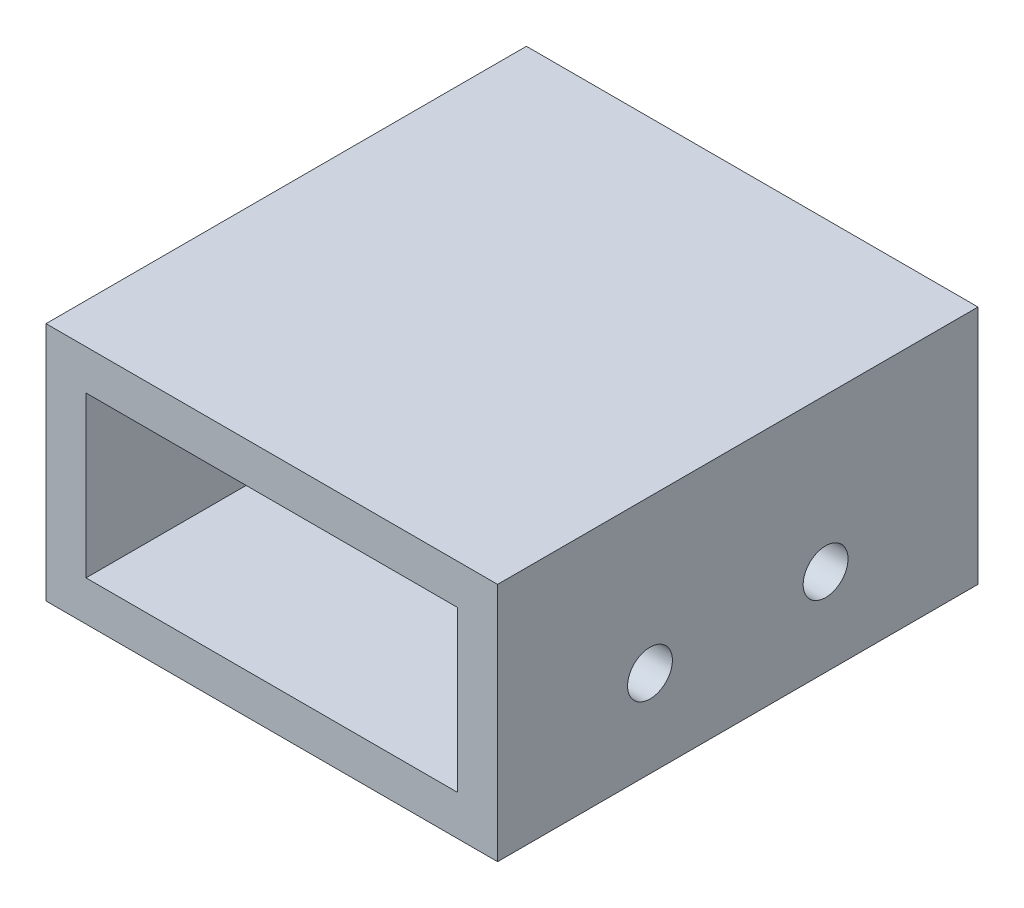
ISO-10303-21;
HEADER;
FILE_DESCRIPTION(('STEP AP214'),'2;1');
FILE_NAME('part.step','',(''),(''),'','','');
FILE_SCHEMA(('AUTOMOTIVE_DESIGN { 1 0 10303 214 1 1 1 1 }'));
ENDSEC;
DATA;
#1=APPLICATION_CONTEXT('core data for automotive mechanical design processes');
#2=APPLICATION_PROTOCOL_DEFINITION('international standard','automotive_design',2000,#1);
#3=PRODUCT_CONTEXT('',#1,'mechanical');
#4=PRODUCT('Part','Part','',(#3));
#5=PRODUCT_RELATED_PRODUCT_CATEGORY('part','',(#4));
#6=PRODUCT_DEFINITION_FORMATION('','',#4);
#7=PRODUCT_DEFINITION_CONTEXT('part definition',#1,'design');
#8=PRODUCT_DEFINITION('design','',#6,#7);
#9=PRODUCT_DEFINITION_SHAPE('','',#8);
#10=(LENGTH_UNIT() NAMED_UNIT(*) SI_UNIT(.MILLI.,.METRE.));
#11=(NAMED_UNIT(*) PLANE_ANGLE_UNIT() SI_UNIT($,.RADIAN.));
#12=(NAMED_UNIT(*) SI_UNIT($,.STERADIAN.) SOLID_ANGLE_UNIT());
#13=UNCERTAINTY_MEASURE_WITH_UNIT(LENGTH_MEASURE(1.E-05),#10,'distance_accuracy_value','');
#14=(GEOMETRIC_REPRESENTATION_CONTEXT(3) GLOBAL_UNCERTAINTY_ASSIGNED_CONTEXT((#13)) GLOBAL_UNIT_ASSIGNED_CONTEXT((#10,
#11,#12)) REPRESENTATION_CONTEXT('',''));
#15=CARTESIAN_POINT('',(0.,0.,0.));
#16=DIRECTION('',(0.,0.,1.));
#17=DIRECTION('',(1.,0.,0.));
#18=AXIS2_PLACEMENT_3D('',#15,#16,#17);
#19=CARTESIAN_POINT('',(-3.175,15.875,-38.1));
#20=DIRECTION('',(-1.,0.,0.));
#21=DIRECTION('',(0.,-1.,0.));
#22=AXIS2_PLACEMENT_3D('',#19,#20,#21);
#23=PLANE('',#22);
#24=DIRECTION('',(0.,0.,1.));
#25=VECTOR('',#24,1.);
#26=CARTESIAN_POINT('',(-3.175,3.175,-38.1));
#27=LINE('',#26,#25);
#28=CARTESIAN_POINT('',(-3.175,3.175,-38.1));
#29=VERTEX_POINT('',#28);
#30=CARTESIAN_POINT('',(-3.175,3.175,0.));
#31=VERTEX_POINT('',#30);
#32=EDGE_CURVE('E146',#29,#31,#27,.T.);
#33=ORIENTED_EDGE('',*,*,#32,.T.);
#34=DIRECTION('',(0.,-1.,0.));
#35=VECTOR('',#34,1.);
#36=CARTESIAN_POINT('',(-3.175,15.875,0.));
#37=LINE('',#36,#35);
#38=CARTESIAN_POINT('',(-3.175,15.875,0.));
#39=VERTEX_POINT('',#38);
#40=EDGE_CURVE('E185',#39,#31,#37,.T.);
#41=ORIENTED_EDGE('',*,*,#40,.F.);
#42=DIRECTION('',(0.,0.,1.));
#43=VECTOR('',#42,1.);
#44=CARTESIAN_POINT('',(-3.175,15.875,-38.1));
#45=LINE('',#44,#43);
#46=CARTESIAN_POINT('',(-3.175,15.875,-38.1));
#47=VERTEX_POINT('',#46);
#48=EDGE_CURVE('E12',#47,#39,#45,.T.);
#49=ORIENTED_EDGE('',*,*,#48,.F.);
#50=DIRECTION('',(0.,-1.,0.));
#51=VECTOR('',#50,1.);
#52=CARTESIAN_POINT('',(-3.175,15.875,-38.1));
#53=LINE('',#52,#51);
#54=EDGE_CURVE('E158',#47,#29,#53,.T.);
#55=ORIENTED_EDGE('',*,*,#54,.T.);
#56=EDGE_LOOP('',(#33,#41,#49,#55));
#57=FACE_BOUND('',#56,.T.);
#58=CARTESIAN_POINT('',(-3.175,6.91388,-12.0859042));
#59=DIRECTION('',(-1.,0.,0.));
#60=DIRECTION('',(0.,-1.,0.));
#61=AXIS2_PLACEMENT_3D('',#58,#59,#60);
#62=CIRCLE('',#61,1.778);
#63=CARTESIAN_POINT('',(-3.175,5.13588,-12.0859042));
#64=VERTEX_POINT('',#63);
#65=EDGE_CURVE('E166',#64,#64,#62,.T.);
#66=ORIENTED_EDGE('',*,*,#65,.F.);
#67=EDGE_LOOP('',(#66));
#68=FACE_BOUND('',#67,.T.);
#69=CARTESIAN_POINT('',(-3.175,6.91388,-26.0140958));
#70=DIRECTION('',(-1.,0.,0.));
#71=DIRECTION('',(0.,-1.,0.));
#72=AXIS2_PLACEMENT_3D('',#69,#70,#71);
#73=CIRCLE('',#72,1.778);
#74=CARTESIAN_POINT('',(-3.175,5.13588,-26.0140958));
#75=VERTEX_POINT('',#74);
#76=EDGE_CURVE('E225',#75,#75,#73,.T.);
#77=ORIENTED_EDGE('',*,*,#76,.F.);
#78=EDGE_LOOP('',(#77));
#79=FACE_BOUND('',#78,.T.);
#80=ADVANCED_FACE('F51',(#57,#68,#79),#23,.T.);
#81=CARTESIAN_POINT('',(-32.639,15.875,-38.1));
#82=DIRECTION('',(0.,-1.,0.));
#83=DIRECTION('',(0.,0.,-1.));
#84=AXIS2_PLACEMENT_3D('',#81,#82,#83);
#85=PLANE('',#84);
#86=DIRECTION('',(1.,0.,0.));
#87=VECTOR('',#86,1.);
#88=CARTESIAN_POINT('',(-32.639,15.875,0.));
#89=LINE('',#88,#87);
#90=CARTESIAN_POINT('',(-32.639,15.875,0.));
#91=VERTEX_POINT('',#90);
#92=EDGE_CURVE('E182',#91,#39,#89,.T.);
#93=ORIENTED_EDGE('',*,*,#92,.F.);
#94=DIRECTION('',(0.,0.,1.));
#95=VECTOR('',#94,1.);
#96=CARTESIAN_POINT('',(-32.639,15.875,-38.1));
#97=LINE('',#96,#95);
#98=CARTESIAN_POINT('',(-32.639,15.875,-38.1));
#99=VERTEX_POINT('',#98);
#100=EDGE_CURVE('E62',#99,#91,#97,.T.);
#101=ORIENTED_EDGE('',*,*,#100,.F.);
#102=DIRECTION('',(1.,0.,0.));
#103=VECTOR('',#102,1.);
#104=CARTESIAN_POINT('',(-32.639,15.875,-38.1));
#105=LINE('',#104,#103);
#106=EDGE_CURVE('E141',#99,#47,#105,.T.);
#107=ORIENTED_EDGE('',*,*,#106,.T.);
#108=ORIENTED_EDGE('',*,*,#48,.T.);
#109=EDGE_LOOP('',(#93,#101,#107,#108));
#110=FACE_BOUND('',#109,.T.);
#111=ADVANCED_FACE('F278',(#110),#85,.T.);
#112=CARTESIAN_POINT('',(-32.639,3.175,-38.1));
#113=DIRECTION('',(1.,0.,0.));
#114=DIRECTION('',(0.,0.,-1.));
#115=AXIS2_PLACEMENT_3D('',#112,#113,#114);
#116=PLANE('',#115);
#117=DIRECTION('',(0.,1.,0.));
#118=VECTOR('',#117,1.);
#119=CARTESIAN_POINT('',(-32.639,3.175,0.));
#120=LINE('',#119,#118);
#121=CARTESIAN_POINT('',(-32.639,3.175,0.));
#122=VERTEX_POINT('',#121);
#123=EDGE_CURVE('E125',#122,#91,#120,.T.);
#124=ORIENTED_EDGE('',*,*,#123,.F.);
#125=DIRECTION('',(0.,0.,1.));
#126=VECTOR('',#125,1.);
#127=CARTESIAN_POINT('',(-32.639,3.175,-38.1));
#128=LINE('',#127,#126);
#129=CARTESIAN_POINT('',(-32.639,3.175,-38.1));
#130=VERTEX_POINT('',#129);
#131=EDGE_CURVE('E120',#130,#122,#128,.T.);
#132=ORIENTED_EDGE('',*,*,#131,.F.);
#133=DIRECTION('',(0.,1.,0.));
#134=VECTOR('',#133,1.);
#135=CARTESIAN_POINT('',(-32.639,3.175,-38.1));
#136=LINE('',#135,#134);
#137=EDGE_CURVE('E123',#130,#99,#136,.T.);
#138=ORIENTED_EDGE('',*,*,#137,.T.);
#139=ORIENTED_EDGE('',*,*,#100,.T.);
#140=EDGE_LOOP('',(#124,#132,#138,#139));
#141=FACE_BOUND('',#140,.T.);
#142=ADVANCED_FACE('F122',(#141),#116,.T.);
#143=CARTESIAN_POINT('',(-21.209,3.175,-38.1));
#144=DIRECTION('',(0.,1.,0.));
#145=DIRECTION('',(-1.,0.,0.));
#146=AXIS2_PLACEMENT_3D('',#143,#144,#145);
#147=PLANE('',#146);
#148=CARTESIAN_POINT('',(-26.543,3.175,-19.05));
#149=DIRECTION('',(0.,1.,0.));
#150=DIRECTION('',(-1.,0.,0.));
#151=AXIS2_PLACEMENT_3D('',#148,#149,#150);
#152=CIRCLE('',#151,1.778);
#153=CARTESIAN_POINT('',(-28.321,3.175,-19.05));
#154=VERTEX_POINT('',#153);
#155=EDGE_CURVE('E239',#154,#154,#152,.T.);
#156=ORIENTED_EDGE('',*,*,#155,.F.);
#157=EDGE_LOOP('',(#156));
#158=FACE_BOUND('',#157,.T.);
#159=CARTESIAN_POINT('',(-7.747,3.175,-19.05));
#160=DIRECTION('',(0.,1.,0.));
#161=DIRECTION('',(-1.,0.,0.));
#162=AXIS2_PLACEMENT_3D('',#159,#160,#161);
#163=CIRCLE('',#162,1.778);
#164=CARTESIAN_POINT('',(-9.525,3.175,-19.05));
#165=VERTEX_POINT('',#164);
#166=EDGE_CURVE('E243',#165,#165,#163,.T.);
#167=ORIENTED_EDGE('',*,*,#166,.F.);
#168=EDGE_LOOP('',(#167));
#169=FACE_BOUND('',#168,.T.);
#170=DIRECTION('',(-1.,0.,0.));
#171=VECTOR('',#170,1.);
#172=CARTESIAN_POINT('',(-21.209,3.175,0.));
#173=LINE('',#172,#171);
#174=EDGE_CURVE('E177',#31,#122,#173,.T.);
#175=ORIENTED_EDGE('',*,*,#174,.F.);
#176=ORIENTED_EDGE('',*,*,#32,.F.);
#177=DIRECTION('',(-1.,0.,0.));
#178=VECTOR('',#177,1.);
#179=CARTESIAN_POINT('',(-21.209,3.175,-38.1));
#180=LINE('',#179,#178);
#181=EDGE_CURVE('E139',#29,#130,#180,.T.);
#182=ORIENTED_EDGE('',*,*,#181,.T.);
#183=ORIENTED_EDGE('',*,*,#131,.T.);
#184=EDGE_LOOP('',(#175,#176,#182,#183));
#185=FACE_BOUND('',#184,.T.);
#186=ADVANCED_FACE('F144',(#158,#169,#185),#147,.T.);
#187=CARTESIAN_POINT('',(-35.814,0.,-38.1));
#188=DIRECTION('',(0.,-1.,0.));
#189=DIRECTION('',(0.,0.,-1.));
#190=AXIS2_PLACEMENT_3D('',#187,#188,#189);
#191=PLANE('',#190);
#192=CARTESIAN_POINT('',(-26.543,0.,-19.05));
#193=DIRECTION('',(0.,-1.,0.));
#194=DIRECTION('',(0.,0.,-1.));
#195=AXIS2_PLACEMENT_3D('',#192,#193,#194);
#196=CIRCLE('',#195,1.778);
#197=CARTESIAN_POINT('',(-26.543,0.,-20.828));
#198=VERTEX_POINT('',#197);
#199=EDGE_CURVE('E247',#198,#198,#196,.T.);
#200=ORIENTED_EDGE('',*,*,#199,.F.);
#201=EDGE_LOOP('',(#200));
#202=FACE_BOUND('',#201,.T.);
#203=CARTESIAN_POINT('',(-7.747,0.,-19.05));
#204=DIRECTION('',(0.,-1.,0.));
#205=DIRECTION('',(0.,0.,-1.));
#206=AXIS2_PLACEMENT_3D('',#203,#204,#205);
#207=CIRCLE('',#206,1.778);
#208=CARTESIAN_POINT('',(-7.747,0.,-20.828));
#209=VERTEX_POINT('',#208);
#210=EDGE_CURVE('E248',#209,#209,#207,.T.);
#211=ORIENTED_EDGE('',*,*,#210,.F.);
#212=EDGE_LOOP('',(#211));
#213=FACE_BOUND('',#212,.T.);
#214=DIRECTION('',(1.,0.,0.));
#215=VECTOR('',#214,1.);
#216=CARTESIAN_POINT('',(-35.814,0.,0.));
#217=LINE('',#216,#215);
#218=CARTESIAN_POINT('',(-35.814,0.,0.));
#219=VERTEX_POINT('',#218);
#220=CARTESIAN_POINT('',(0.,0.,0.));
#221=VERTEX_POINT('',#220);
#222=EDGE_CURVE('E174',#219,#221,#217,.T.);
#223=ORIENTED_EDGE('',*,*,#222,.F.);
#224=DIRECTION('',(0.,0.,1.));
#225=VECTOR('',#224,1.);
#226=CARTESIAN_POINT('',(-35.814,0.,-38.1));
#227=LINE('',#226,#225);
#228=CARTESIAN_POINT('',(-35.814,0.,-38.1));
#229=VERTEX_POINT('',#228);
#230=EDGE_CURVE('E131',#229,#219,#227,.T.);
#231=ORIENTED_EDGE('',*,*,#230,.F.);
#232=DIRECTION('',(1.,0.,0.));
#233=VECTOR('',#232,1.);
#234=CARTESIAN_POINT('',(-3.175,0.,-38.1));
#235=LINE('',#234,#233);
#236=CARTESIAN_POINT('',(0.,0.,-38.1));
#237=VERTEX_POINT('',#236);
#238=EDGE_CURVE('E188',#229,#237,#235,.T.);
#239=ORIENTED_EDGE('',*,*,#238,.T.);
#240=DIRECTION('',(0.,0.,1.));
#241=VECTOR('',#240,1.);
#242=CARTESIAN_POINT('',(0.,0.,-38.1));
#243=LINE('',#242,#241);
#244=EDGE_CURVE('E55',#237,#221,#243,.T.);
#245=ORIENTED_EDGE('',*,*,#244,.T.);
#246=EDGE_LOOP('',(#223,#231,#239,#245));
#247=FACE_BOUND('',#246,.T.);
#248=ADVANCED_FACE('F203',(#202,#213,#247),#191,.T.);
#249=CARTESIAN_POINT('',(-35.814,19.05,-38.1));
#250=DIRECTION('',(-1.,0.,0.));
#251=DIRECTION('',(0.,0.,1.));
#252=AXIS2_PLACEMENT_3D('',#249,#250,#251);
#253=PLANE('',#252);
#254=DIRECTION('',(0.,-1.,0.));
#255=VECTOR('',#254,1.);
#256=CARTESIAN_POINT('',(-35.814,19.05,0.));
#257=LINE('',#256,#255);
#258=CARTESIAN_POINT('',(-35.814,19.05,0.));
#259=VERTEX_POINT('',#258);
#260=EDGE_CURVE('E170',#259,#219,#257,.T.);
#261=ORIENTED_EDGE('',*,*,#260,.F.);
#262=DIRECTION('',(0.,0.,1.));
#263=VECTOR('',#262,1.);
#264=CARTESIAN_POINT('',(-35.814,19.05,-38.1));
#265=LINE('',#264,#263);
#266=CARTESIAN_POINT('',(-35.814,19.05,-38.1));
#267=VERTEX_POINT('',#266);
#268=EDGE_CURVE('E194',#267,#259,#265,.T.);
#269=ORIENTED_EDGE('',*,*,#268,.F.);
#270=DIRECTION('',(0.,-1.,0.));
#271=VECTOR('',#270,1.);
#272=CARTESIAN_POINT('',(-35.814,19.05,-38.1));
#273=LINE('',#272,#271);
#274=EDGE_CURVE('E148',#267,#229,#273,.T.);
#275=ORIENTED_EDGE('',*,*,#274,.T.);
#276=ORIENTED_EDGE('',*,*,#230,.T.);
#277=EDGE_LOOP('',(#261,#269,#275,#276));
#278=FACE_BOUND('',#277,.T.);
#279=ADVANCED_FACE('F209',(#278),#253,.T.);
#280=CARTESIAN_POINT('',(0.,19.05,-38.1));
#281=DIRECTION('',(0.,1.,0.));
#282=DIRECTION('',(-1.,0.,0.));
#283=AXIS2_PLACEMENT_3D('',#280,#281,#282);
#284=PLANE('',#283);
#285=DIRECTION('',(-1.,0.,0.));
#286=VECTOR('',#285,1.);
#287=CARTESIAN_POINT('',(0.,19.05,0.));
#288=LINE('',#287,#286);
#289=CARTESIAN_POINT('',(0.,19.05,0.));
#290=VERTEX_POINT('',#289);
#291=EDGE_CURVE('E165',#290,#259,#288,.T.);
#292=ORIENTED_EDGE('',*,*,#291,.F.);
#293=DIRECTION('',(0.,0.,1.));
#294=VECTOR('',#293,1.);
#295=CARTESIAN_POINT('',(0.,19.05,-38.1));
#296=LINE('',#295,#294);
#297=CARTESIAN_POINT('',(0.,19.05,-38.1));
#298=VERTEX_POINT('',#297);
#299=EDGE_CURVE('E196',#298,#290,#296,.T.);
#300=ORIENTED_EDGE('',*,*,#299,.F.);
#301=DIRECTION('',(-1.,0.,0.));
#302=VECTOR('',#301,1.);
#303=CARTESIAN_POINT('',(0.,19.05,-38.1));
#304=LINE('',#303,#302);
#305=EDGE_CURVE('E152',#298,#267,#304,.T.);
#306=ORIENTED_EDGE('',*,*,#305,.T.);
#307=ORIENTED_EDGE('',*,*,#268,.T.);
#308=EDGE_LOOP('',(#292,#300,#306,#307));
#309=FACE_BOUND('',#308,.T.);
#310=ADVANCED_FACE('F214',(#309),#284,.T.);
#311=CARTESIAN_POINT('',(0.,0.,-38.1));
#312=DIRECTION('',(1.,0.,0.));
#313=DIRECTION('',(0.,0.,-1.));
#314=AXIS2_PLACEMENT_3D('',#311,#312,#313);
#315=PLANE('',#314);
#316=CARTESIAN_POINT('',(0.,6.91388,-12.0859042));
#317=DIRECTION('',(1.,0.,0.));
#318=DIRECTION('',(0.,0.,-1.));
#319=AXIS2_PLACEMENT_3D('',#316,#317,#318);
#320=CIRCLE('',#319,1.778);
#321=CARTESIAN_POINT('',(0.,6.91388,-13.8639042));
#322=VERTEX_POINT('',#321);
#323=EDGE_CURVE('E229',#322,#322,#320,.T.);
#324=ORIENTED_EDGE('',*,*,#323,.F.);
#325=EDGE_LOOP('',(#324));
#326=FACE_BOUND('',#325,.T.);
#327=CARTESIAN_POINT('',(0.,6.91388,-26.0140958));
#328=DIRECTION('',(1.,0.,0.));
#329=DIRECTION('',(0.,0.,-1.));
#330=AXIS2_PLACEMENT_3D('',#327,#328,#329);
#331=CIRCLE('',#330,1.778);
#332=CARTESIAN_POINT('',(0.,6.91388,-27.7920958));
#333=VERTEX_POINT('',#332);
#334=EDGE_CURVE('E230',#333,#333,#331,.T.);
#335=ORIENTED_EDGE('',*,*,#334,.F.);
#336=EDGE_LOOP('',(#335));
#337=FACE_BOUND('',#336,.T.);
#338=DIRECTION('',(0.,1.,0.));
#339=VECTOR('',#338,1.);
#340=CARTESIAN_POINT('',(0.,0.,0.));
#341=LINE('',#340,#339);
#342=EDGE_CURVE('E161',#221,#290,#341,.T.);
#343=ORIENTED_EDGE('',*,*,#342,.F.);
#344=ORIENTED_EDGE('',*,*,#244,.F.);
#345=DIRECTION('',(0.,1.,0.));
#346=VECTOR('',#345,1.);
#347=CARTESIAN_POINT('',(0.,0.,-38.1));
#348=LINE('',#347,#346);
#349=EDGE_CURVE('E216',#237,#298,#348,.T.);
#350=ORIENTED_EDGE('',*,*,#349,.T.);
#351=ORIENTED_EDGE('',*,*,#299,.T.);
#352=EDGE_LOOP('',(#343,#344,#350,#351));
#353=FACE_BOUND('',#352,.T.);
#354=ADVANCED_FACE('F53',(#326,#337,#353),#315,.T.);
#355=CARTESIAN_POINT('',(0.,0.,-38.1));
#356=DIRECTION('',(0.,0.,1.));
#357=DIRECTION('',(1.,0.,0.));
#358=AXIS2_PLACEMENT_3D('',#355,#356,#357);
#359=PLANE('',#358);
#360=ORIENTED_EDGE('',*,*,#181,.F.);
#361=ORIENTED_EDGE('',*,*,#54,.F.);
#362=ORIENTED_EDGE('',*,*,#106,.F.);
#363=ORIENTED_EDGE('',*,*,#137,.F.);
#364=EDGE_LOOP('',(#360,#361,#362,#363));
#365=FACE_BOUND('',#364,.T.);
#366=ORIENTED_EDGE('',*,*,#238,.F.);
#367=ORIENTED_EDGE('',*,*,#274,.F.);
#368=ORIENTED_EDGE('',*,*,#305,.F.);
#369=ORIENTED_EDGE('',*,*,#349,.F.);
#370=EDGE_LOOP('',(#366,#367,#368,#369));
#371=FACE_BOUND('',#370,.T.);
#372=ADVANCED_FACE('F136',(#365,#371),#359,.F.);
#373=CARTESIAN_POINT('',(0.,0.,0.));
#374=DIRECTION('',(0.,0.,1.));
#375=DIRECTION('',(1.,0.,0.));
#376=AXIS2_PLACEMENT_3D('',#373,#374,#375);
#377=PLANE('',#376);
#378=ORIENTED_EDGE('',*,*,#40,.T.);
#379=ORIENTED_EDGE('',*,*,#174,.T.);
#380=ORIENTED_EDGE('',*,*,#123,.T.);
#381=ORIENTED_EDGE('',*,*,#92,.T.);
#382=EDGE_LOOP('',(#378,#379,#380,#381));
#383=FACE_BOUND('',#382,.T.);
#384=ORIENTED_EDGE('',*,*,#222,.T.);
#385=ORIENTED_EDGE('',*,*,#342,.T.);
#386=ORIENTED_EDGE('',*,*,#291,.T.);
#387=ORIENTED_EDGE('',*,*,#260,.T.);
#388=EDGE_LOOP('',(#384,#385,#386,#387));
#389=FACE_BOUND('',#388,.T.);
#390=ADVANCED_FACE('F206',(#383,#389),#377,.T.);
#391=CARTESIAN_POINT('',(-15.24,6.91388,-26.0140958));
#392=DIRECTION('',(1.,0.,0.));
#393=DIRECTION('',(0.,0.,-1.));
#394=AXIS2_PLACEMENT_3D('',#391,#392,#393);
#395=CYLINDRICAL_SURFACE('',#394,1.778);
#396=ORIENTED_EDGE('',*,*,#76,.T.);
#397=EDGE_LOOP('',(#396));
#398=FACE_BOUND('',#397,.T.);
#399=ORIENTED_EDGE('',*,*,#334,.T.);
#400=EDGE_LOOP('',(#399));
#401=FACE_BOUND('',#400,.T.);
#402=ADVANCED_FACE('F274',(#398,#401),#395,.F.);
#403=CARTESIAN_POINT('',(-15.24,6.91388,-12.0859042));
#404=DIRECTION('',(1.,0.,0.));
#405=DIRECTION('',(0.,0.,-1.));
#406=AXIS2_PLACEMENT_3D('',#403,#404,#405);
#407=CYLINDRICAL_SURFACE('',#406,1.778);
#408=ORIENTED_EDGE('',*,*,#65,.T.);
#409=EDGE_LOOP('',(#408));
#410=FACE_BOUND('',#409,.T.);
#411=ORIENTED_EDGE('',*,*,#323,.T.);
#412=EDGE_LOOP('',(#411));
#413=FACE_BOUND('',#412,.T.);
#414=ADVANCED_FACE('F265',(#410,#413),#407,.F.);
#415=CARTESIAN_POINT('',(-7.747,15.24,-19.05));
#416=DIRECTION('',(0.,-1.,0.));
#417=DIRECTION('',(0.,0.,-1.));
#418=AXIS2_PLACEMENT_3D('',#415,#416,#417);
#419=CYLINDRICAL_SURFACE('',#418,1.778);
#420=ORIENTED_EDGE('',*,*,#166,.T.);
#421=EDGE_LOOP('',(#420));
#422=FACE_BOUND('',#421,.T.);
#423=ORIENTED_EDGE('',*,*,#210,.T.);
#424=EDGE_LOOP('',(#423));
#425=FACE_BOUND('',#424,.T.);
#426=ADVANCED_FACE('F263',(#422,#425),#419,.F.);
#427=CARTESIAN_POINT('',(-26.543,15.24,-19.05));
#428=DIRECTION('',(0.,-1.,0.));
#429=DIRECTION('',(0.,0.,-1.));
#430=AXIS2_PLACEMENT_3D('',#427,#428,#429);
#431=CYLINDRICAL_SURFACE('',#430,1.778);
#432=ORIENTED_EDGE('',*,*,#155,.T.);
#433=EDGE_LOOP('',(#432));
#434=FACE_BOUND('',#433,.T.);
#435=ORIENTED_EDGE('',*,*,#199,.T.);
#436=EDGE_LOOP('',(#435));
#437=FACE_BOUND('',#436,.T.);
#438=ADVANCED_FACE('F256',(#434,#437),#431,.F.);
#439=CLOSED_SHELL('',(#80,#111,#142,#186,#248,#279,#310,#354,#372,#390,#402,#414,#426,#438));
#440=MANIFOLD_SOLID_BREP('B2',#439);
#441=ADVANCED_BREP_SHAPE_REPRESENTATION('',(#18,#440),#14);
#442=SHAPE_DEFINITION_REPRESENTATION(#9,#441);
ENDSEC;
END-ISO-10303-21;
